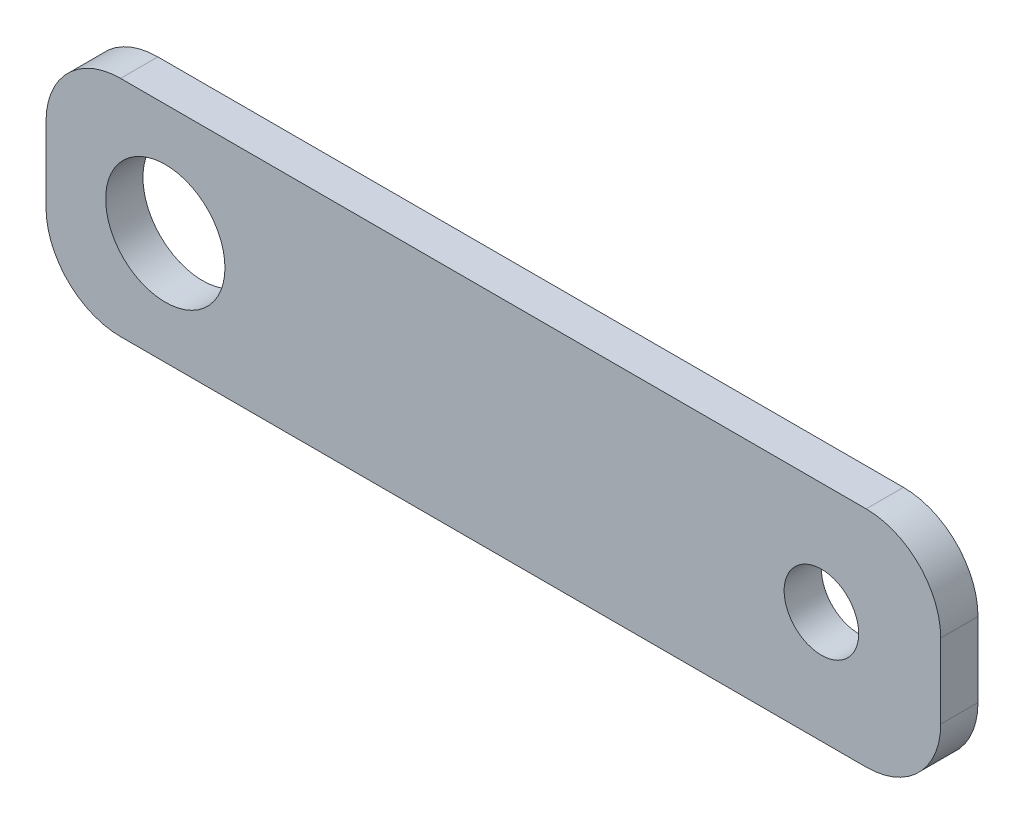
ISO-10303-21;
HEADER;
FILE_DESCRIPTION(('STEP AP214'),'2;1');
FILE_NAME('part.step','',(''),(''),'','','');
FILE_SCHEMA(('AUTOMOTIVE_DESIGN { 1 0 10303 214 1 1 1 1 }'));
ENDSEC;
DATA;
#1=APPLICATION_CONTEXT('core data for automotive mechanical design processes');
#2=APPLICATION_PROTOCOL_DEFINITION('international standard','automotive_design',2000,#1);
#3=PRODUCT_CONTEXT('',#1,'mechanical');
#4=PRODUCT('Part','Part','',(#3));
#5=PRODUCT_RELATED_PRODUCT_CATEGORY('part','',(#4));
#6=PRODUCT_DEFINITION_FORMATION('','',#4);
#7=PRODUCT_DEFINITION_CONTEXT('part definition',#1,'design');
#8=PRODUCT_DEFINITION('design','',#6,#7);
#9=PRODUCT_DEFINITION_SHAPE('','',#8);
#10=(LENGTH_UNIT() NAMED_UNIT(*) SI_UNIT(.MILLI.,.METRE.));
#11=(NAMED_UNIT(*) PLANE_ANGLE_UNIT() SI_UNIT($,.RADIAN.));
#12=(NAMED_UNIT(*) SI_UNIT($,.STERADIAN.) SOLID_ANGLE_UNIT());
#13=UNCERTAINTY_MEASURE_WITH_UNIT(LENGTH_MEASURE(1.E-05),#10,'distance_accuracy_value','');
#14=(GEOMETRIC_REPRESENTATION_CONTEXT(3) GLOBAL_UNCERTAINTY_ASSIGNED_CONTEXT((#13)) GLOBAL_UNIT_ASSIGNED_CONTEXT((#10,
#11,#12)) REPRESENTATION_CONTEXT('',''));
#15=CARTESIAN_POINT('',(0.,0.,0.));
#16=DIRECTION('',(0.,0.,1.));
#17=DIRECTION('',(1.,0.,0.));
#18=AXIS2_PLACEMENT_3D('',#15,#16,#17);
#19=CARTESIAN_POINT('',(-60.0000000000003,-15.0000000000002,5.));
#20=DIRECTION('',(1.00000000000001,0.,0.));
#21=DIRECTION('',(0.,0.,-1.));
#22=AXIS2_PLACEMENT_3D('',#19,#20,#21);
#23=PLANE('',#22);
#24=DIRECTION('',(0.,-1.00000000000001,0.));
#25=VECTOR('',#24,1.);
#26=CARTESIAN_POINT('',(-60.0000000000003,-15.0000000000002,0.));
#27=LINE('',#26,#25);
#28=CARTESIAN_POINT('',(-60.0000000000002,4.99999999999994,0.));
#29=VERTEX_POINT('',#28);
#30=CARTESIAN_POINT('',(-60.0000000000001,-5.00000000000002,0.));
#31=VERTEX_POINT('',#30);
#32=EDGE_CURVE('E131',#29,#31,#27,.T.);
#33=ORIENTED_EDGE('',*,*,#32,.T.);
#34=DIRECTION('',(0.,0.,-1.));
#35=VECTOR('',#34,1.);
#36=CARTESIAN_POINT('',(-60.0000000000001,-5.00000000000002,5.));
#37=LINE('',#36,#35);
#38=CARTESIAN_POINT('',(-60.0000000000001,-5.00000000000002,5.));
#39=VERTEX_POINT('',#38);
#40=EDGE_CURVE('E11',#31,#39,#37,.F.);
#41=ORIENTED_EDGE('',*,*,#40,.T.);
#42=DIRECTION('',(0.,-1.00000000000001,0.));
#43=VECTOR('',#42,1.);
#44=CARTESIAN_POINT('',(-60.0000000000003,-15.0000000000002,5.));
#45=LINE('',#44,#43);
#46=CARTESIAN_POINT('',(-60.0000000000002,4.99999999999994,5.));
#47=VERTEX_POINT('',#46);
#48=EDGE_CURVE('E129',#47,#39,#45,.T.);
#49=ORIENTED_EDGE('',*,*,#48,.F.);
#50=DIRECTION('',(0.,0.,-1.));
#51=VECTOR('',#50,1.);
#52=CARTESIAN_POINT('',(-60.0000000000002,4.99999999999994,5.));
#53=LINE('',#52,#51);
#54=EDGE_CURVE('E43',#47,#29,#53,.T.);
#55=ORIENTED_EDGE('',*,*,#54,.T.);
#56=EDGE_LOOP('',(#33,#41,#49,#55));
#57=FACE_BOUND('',#56,.T.);
#58=ADVANCED_FACE('F35',(#57),#23,.F.);
#59=CARTESIAN_POINT('',(60.0000000000001,-15.,5.));
#60=DIRECTION('',(0.,1.00000000000001,0.));
#61=DIRECTION('',(-1.00000000000001,0.,0.));
#62=AXIS2_PLACEMENT_3D('',#59,#60,#61);
#63=PLANE('',#62);
#64=DIRECTION('',(1.00000000000001,0.,0.));
#65=VECTOR('',#64,1.);
#66=CARTESIAN_POINT('',(60.0000000000001,-15.,0.));
#67=LINE('',#66,#65);
#68=CARTESIAN_POINT('',(-50.0000000000002,-15.0000000000002,0.));
#69=VERTEX_POINT('',#68);
#70=CARTESIAN_POINT('',(50.,-15.,0.));
#71=VERTEX_POINT('',#70);
#72=EDGE_CURVE('E127',#69,#71,#67,.T.);
#73=ORIENTED_EDGE('',*,*,#72,.T.);
#74=DIRECTION('',(0.,0.,-1.));
#75=VECTOR('',#74,1.);
#76=CARTESIAN_POINT('',(50.,-15.,5.));
#77=LINE('',#76,#75);
#78=CARTESIAN_POINT('',(50.,-15.,5.));
#79=VERTEX_POINT('',#78);
#80=EDGE_CURVE('E106',#71,#79,#77,.F.);
#81=ORIENTED_EDGE('',*,*,#80,.T.);
#82=DIRECTION('',(1.00000000000001,0.,0.));
#83=VECTOR('',#82,1.);
#84=CARTESIAN_POINT('',(60.0000000000001,-15.,5.));
#85=LINE('',#84,#83);
#86=CARTESIAN_POINT('',(-50.0000000000002,-15.0000000000002,5.));
#87=VERTEX_POINT('',#86);
#88=EDGE_CURVE('E174',#87,#79,#85,.T.);
#89=ORIENTED_EDGE('',*,*,#88,.F.);
#90=DIRECTION('',(0.,0.,-1.));
#91=VECTOR('',#90,1.);
#92=CARTESIAN_POINT('',(-50.0000000000002,-15.0000000000002,5.));
#93=LINE('',#92,#91);
#94=EDGE_CURVE('E111',#87,#69,#93,.T.);
#95=ORIENTED_EDGE('',*,*,#94,.T.);
#96=EDGE_LOOP('',(#73,#81,#89,#95));
#97=FACE_BOUND('',#96,.T.);
#98=ADVANCED_FACE('F197',(#97),#63,.F.);
#99=CARTESIAN_POINT('',(60.0000000000001,-15.,5.));
#100=DIRECTION('',(-1.00000000000001,0.,0.));
#101=DIRECTION('',(0.,-1.00000000000001,0.));
#102=AXIS2_PLACEMENT_3D('',#99,#100,#101);
#103=PLANE('',#102);
#104=DIRECTION('',(0.,1.00000000000001,0.));
#105=VECTOR('',#104,1.);
#106=CARTESIAN_POINT('',(60.0000000000001,-15.,5.));
#107=LINE('',#106,#105);
#108=CARTESIAN_POINT('',(60.0000000000001,-5.,5.));
#109=VERTEX_POINT('',#108);
#110=CARTESIAN_POINT('',(60.,4.99999999999999,5.));
#111=VERTEX_POINT('',#110);
#112=EDGE_CURVE('E120',#109,#111,#107,.T.);
#113=ORIENTED_EDGE('',*,*,#112,.F.);
#114=DIRECTION('',(0.,0.,-1.));
#115=VECTOR('',#114,1.);
#116=CARTESIAN_POINT('',(60.0000000000001,-5.,5.));
#117=LINE('',#116,#115);
#118=CARTESIAN_POINT('',(60.0000000000001,-5.,0.));
#119=VERTEX_POINT('',#118);
#120=EDGE_CURVE('E105',#109,#119,#117,.T.);
#121=ORIENTED_EDGE('',*,*,#120,.T.);
#122=DIRECTION('',(0.,1.00000000000001,0.));
#123=VECTOR('',#122,1.);
#124=CARTESIAN_POINT('',(60.0000000000001,-15.,0.));
#125=LINE('',#124,#123);
#126=CARTESIAN_POINT('',(60.,4.99999999999999,0.));
#127=VERTEX_POINT('',#126);
#128=EDGE_CURVE('E118',#119,#127,#125,.T.);
#129=ORIENTED_EDGE('',*,*,#128,.T.);
#130=DIRECTION('',(0.,0.,-1.));
#131=VECTOR('',#130,1.);
#132=CARTESIAN_POINT('',(60.,4.99999999999999,5.));
#133=LINE('',#132,#131);
#134=EDGE_CURVE('E122',#127,#111,#133,.F.);
#135=ORIENTED_EDGE('',*,*,#134,.T.);
#136=EDGE_LOOP('',(#113,#121,#129,#135));
#137=FACE_BOUND('',#136,.T.);
#138=ADVANCED_FACE('F117',(#137),#103,.F.);
#139=CARTESIAN_POINT('',(60.,15.,5.));
#140=DIRECTION('',(0.,-1.00000000000001,0.));
#141=DIRECTION('',(1.00000000000001,0.,0.));
#142=AXIS2_PLACEMENT_3D('',#139,#140,#141);
#143=PLANE('',#142);
#144=DIRECTION('',(-1.00000000000001,0.,0.));
#145=VECTOR('',#144,1.);
#146=CARTESIAN_POINT('',(60.,15.,5.));
#147=LINE('',#146,#145);
#148=CARTESIAN_POINT('',(50.0000000000003,15.0000000000001,5.));
#149=VERTEX_POINT('',#148);
#150=CARTESIAN_POINT('',(-50.0000000000003,15.,5.));
#151=VERTEX_POINT('',#150);
#152=EDGE_CURVE('E142',#149,#151,#147,.T.);
#153=ORIENTED_EDGE('',*,*,#152,.F.);
#154=DIRECTION('',(0.,0.,-1.));
#155=VECTOR('',#154,1.);
#156=CARTESIAN_POINT('',(50.0000000000003,15.0000000000001,5.));
#157=LINE('',#156,#155);
#158=CARTESIAN_POINT('',(50.0000000000003,15.0000000000001,0.));
#159=VERTEX_POINT('',#158);
#160=EDGE_CURVE('E159',#149,#159,#157,.T.);
#161=ORIENTED_EDGE('',*,*,#160,.T.);
#162=DIRECTION('',(-1.00000000000001,0.,0.));
#163=VECTOR('',#162,1.);
#164=CARTESIAN_POINT('',(60.,15.,0.));
#165=LINE('',#164,#163);
#166=CARTESIAN_POINT('',(-50.0000000000003,15.,0.));
#167=VERTEX_POINT('',#166);
#168=EDGE_CURVE('E126',#159,#167,#165,.T.);
#169=ORIENTED_EDGE('',*,*,#168,.T.);
#170=DIRECTION('',(0.,0.,-1.));
#171=VECTOR('',#170,1.);
#172=CARTESIAN_POINT('',(-50.0000000000003,15.,5.));
#173=LINE('',#172,#171);
#174=EDGE_CURVE('E50',#167,#151,#173,.F.);
#175=ORIENTED_EDGE('',*,*,#174,.T.);
#176=EDGE_LOOP('',(#153,#161,#169,#175));
#177=FACE_BOUND('',#176,.T.);
#178=ADVANCED_FACE('F190',(#177),#143,.F.);
#179=CARTESIAN_POINT('',(0.,0.,5.));
#180=DIRECTION('',(0.,0.,1.));
#181=DIRECTION('',(1.00000000000001,0.,0.));
#182=AXIS2_PLACEMENT_3D('',#179,#180,#181);
#183=PLANE('',#182);
#184=CARTESIAN_POINT('',(-44.,0.,5.));
#185=DIRECTION('',(0.,0.,1.));
#186=DIRECTION('',(1.00000000000001,0.,0.));
#187=AXIS2_PLACEMENT_3D('',#184,#185,#186);
#188=CIRCLE('',#187,8.);
#189=CARTESIAN_POINT('',(-36.,0.,5.));
#190=VERTEX_POINT('',#189);
#191=EDGE_CURVE('E139',#190,#190,#188,.T.);
#192=ORIENTED_EDGE('',*,*,#191,.F.);
#193=EDGE_LOOP('',(#192));
#194=FACE_BOUND('',#193,.T.);
#195=CARTESIAN_POINT('',(44.0000000000001,0.,5.));
#196=DIRECTION('',(0.,0.,1.));
#197=DIRECTION('',(1.00000000000001,0.,0.));
#198=AXIS2_PLACEMENT_3D('',#195,#196,#197);
#199=CIRCLE('',#198,5.);
#200=CARTESIAN_POINT('',(49.0000000000002,0.,5.));
#201=VERTEX_POINT('',#200);
#202=EDGE_CURVE('E178',#201,#201,#199,.T.);
#203=ORIENTED_EDGE('',*,*,#202,.F.);
#204=EDGE_LOOP('',(#203));
#205=FACE_BOUND('',#204,.T.);
#206=ORIENTED_EDGE('',*,*,#88,.T.);
#207=CARTESIAN_POINT('',(50.,-4.99999999999999,5.));
#208=DIRECTION('',(0.,0.,1.));
#209=DIRECTION('',(1.00000000000001,0.,0.));
#210=AXIS2_PLACEMENT_3D('',#207,#208,#209);
#211=CIRCLE('',#210,10.);
#212=EDGE_CURVE('E156',#79,#109,#211,.T.);
#213=ORIENTED_EDGE('',*,*,#212,.T.);
#214=ORIENTED_EDGE('',*,*,#112,.T.);
#215=CARTESIAN_POINT('',(50.,4.99999999999999,5.));
#216=DIRECTION('',(0.,0.,1.));
#217=DIRECTION('',(1.00000000000001,0.,0.));
#218=AXIS2_PLACEMENT_3D('',#215,#216,#217);
#219=CIRCLE('',#218,10.);
#220=EDGE_CURVE('E57',#111,#149,#219,.T.);
#221=ORIENTED_EDGE('',*,*,#220,.T.);
#222=ORIENTED_EDGE('',*,*,#152,.T.);
#223=CARTESIAN_POINT('',(-50.,4.99999999999999,5.));
#224=DIRECTION('',(0.,0.,1.));
#225=DIRECTION('',(1.00000000000001,0.,0.));
#226=AXIS2_PLACEMENT_3D('',#223,#224,#225);
#227=CIRCLE('',#226,10.);
#228=EDGE_CURVE('E151',#151,#47,#227,.T.);
#229=ORIENTED_EDGE('',*,*,#228,.T.);
#230=ORIENTED_EDGE('',*,*,#48,.T.);
#231=CARTESIAN_POINT('',(-50.0000000000001,-5.00000000000005,5.));
#232=DIRECTION('',(0.,0.,1.));
#233=DIRECTION('',(1.00000000000001,0.,0.));
#234=AXIS2_PLACEMENT_3D('',#231,#232,#233);
#235=CIRCLE('',#234,10.);
#236=EDGE_CURVE('E153',#39,#87,#235,.T.);
#237=ORIENTED_EDGE('',*,*,#236,.T.);
#238=EDGE_LOOP('',(#206,#213,#214,#221,#222,#229,#230,#237));
#239=FACE_BOUND('',#238,.T.);
#240=ADVANCED_FACE('F187',(#194,#205,#239),#183,.T.);
#241=CARTESIAN_POINT('',(0.,0.,0.));
#242=DIRECTION('',(0.,0.,1.));
#243=DIRECTION('',(1.00000000000001,0.,0.));
#244=AXIS2_PLACEMENT_3D('',#241,#242,#243);
#245=PLANE('',#244);
#246=CARTESIAN_POINT('',(-44.,0.,0.));
#247=DIRECTION('',(0.,0.,1.));
#248=DIRECTION('',(1.00000000000001,0.,0.));
#249=AXIS2_PLACEMENT_3D('',#246,#247,#248);
#250=CIRCLE('',#249,8.);
#251=CARTESIAN_POINT('',(-36.,0.,0.));
#252=VERTEX_POINT('',#251);
#253=EDGE_CURVE('E138',#252,#252,#250,.T.);
#254=ORIENTED_EDGE('',*,*,#253,.T.);
#255=EDGE_LOOP('',(#254));
#256=FACE_BOUND('',#255,.T.);
#257=CARTESIAN_POINT('',(44.0000000000001,0.,0.));
#258=DIRECTION('',(0.,0.,1.));
#259=DIRECTION('',(1.00000000000001,0.,0.));
#260=AXIS2_PLACEMENT_3D('',#257,#258,#259);
#261=CIRCLE('',#260,5.);
#262=CARTESIAN_POINT('',(49.0000000000002,0.,0.));
#263=VERTEX_POINT('',#262);
#264=EDGE_CURVE('E135',#263,#263,#261,.T.);
#265=ORIENTED_EDGE('',*,*,#264,.T.);
#266=EDGE_LOOP('',(#265));
#267=FACE_BOUND('',#266,.T.);
#268=ORIENTED_EDGE('',*,*,#128,.F.);
#269=CARTESIAN_POINT('',(50.,-4.99999999999999,0.));
#270=DIRECTION('',(0.,0.,1.));
#271=DIRECTION('',(1.00000000000001,0.,0.));
#272=AXIS2_PLACEMENT_3D('',#269,#270,#271);
#273=CIRCLE('',#272,10.);
#274=EDGE_CURVE('E101',#119,#71,#273,.F.);
#275=ORIENTED_EDGE('',*,*,#274,.T.);
#276=ORIENTED_EDGE('',*,*,#72,.F.);
#277=CARTESIAN_POINT('',(-50.0000000000001,-5.00000000000005,0.));
#278=DIRECTION('',(0.,0.,1.));
#279=DIRECTION('',(1.00000000000001,0.,0.));
#280=AXIS2_PLACEMENT_3D('',#277,#278,#279);
#281=CIRCLE('',#280,10.);
#282=EDGE_CURVE('E145',#69,#31,#281,.F.);
#283=ORIENTED_EDGE('',*,*,#282,.T.);
#284=ORIENTED_EDGE('',*,*,#32,.F.);
#285=CARTESIAN_POINT('',(-50.,4.99999999999999,0.));
#286=DIRECTION('',(0.,0.,1.));
#287=DIRECTION('',(1.00000000000001,0.,0.));
#288=AXIS2_PLACEMENT_3D('',#285,#286,#287);
#289=CIRCLE('',#288,10.);
#290=EDGE_CURVE('E121',#29,#167,#289,.F.);
#291=ORIENTED_EDGE('',*,*,#290,.T.);
#292=ORIENTED_EDGE('',*,*,#168,.F.);
#293=CARTESIAN_POINT('',(50.,4.99999999999999,0.));
#294=DIRECTION('',(0.,0.,1.));
#295=DIRECTION('',(1.00000000000001,0.,0.));
#296=AXIS2_PLACEMENT_3D('',#293,#294,#295);
#297=CIRCLE('',#296,10.);
#298=EDGE_CURVE('E112',#159,#127,#297,.F.);
#299=ORIENTED_EDGE('',*,*,#298,.T.);
#300=EDGE_LOOP('',(#268,#275,#276,#283,#284,#291,#292,#299));
#301=FACE_BOUND('',#300,.T.);
#302=ADVANCED_FACE('F124',(#256,#267,#301),#245,.F.);
#303=CARTESIAN_POINT('',(44.0000000000001,0.,-5.));
#304=DIRECTION('',(0.,0.,1.));
#305=DIRECTION('',(1.00000000000001,0.,0.));
#306=AXIS2_PLACEMENT_3D('',#303,#304,#305);
#307=CYLINDRICAL_SURFACE('',#306,5.);
#308=ORIENTED_EDGE('',*,*,#202,.T.);
#309=EDGE_LOOP('',(#308));
#310=FACE_BOUND('',#309,.T.);
#311=ORIENTED_EDGE('',*,*,#264,.F.);
#312=EDGE_LOOP('',(#311));
#313=FACE_BOUND('',#312,.T.);
#314=ADVANCED_FACE('F227',(#310,#313),#307,.F.);
#315=CARTESIAN_POINT('',(-44.,0.,-5.));
#316=DIRECTION('',(0.,0.,1.));
#317=DIRECTION('',(1.00000000000001,0.,0.));
#318=AXIS2_PLACEMENT_3D('',#315,#316,#317);
#319=CYLINDRICAL_SURFACE('',#318,8.);
#320=ORIENTED_EDGE('',*,*,#191,.T.);
#321=EDGE_LOOP('',(#320));
#322=FACE_BOUND('',#321,.T.);
#323=ORIENTED_EDGE('',*,*,#253,.F.);
#324=EDGE_LOOP('',(#323));
#325=FACE_BOUND('',#324,.T.);
#326=ADVANCED_FACE('F184',(#322,#325),#319,.F.);
#327=CARTESIAN_POINT('',(50.,-4.99999999999999,5.));
#328=DIRECTION('',(0.,0.,-1.));
#329=DIRECTION('',(-1.00000000000001,0.,0.));
#330=AXIS2_PLACEMENT_3D('',#327,#328,#329);
#331=CYLINDRICAL_SURFACE('',#330,10.);
#332=ORIENTED_EDGE('',*,*,#212,.F.);
#333=ORIENTED_EDGE('',*,*,#80,.F.);
#334=ORIENTED_EDGE('',*,*,#274,.F.);
#335=ORIENTED_EDGE('',*,*,#120,.F.);
#336=EDGE_LOOP('',(#332,#333,#334,#335));
#337=FACE_BOUND('',#336,.T.);
#338=ADVANCED_FACE('F104',(#337),#331,.T.);
#339=CARTESIAN_POINT('',(50.,4.99999999999999,5.));
#340=DIRECTION('',(0.,0.,-1.));
#341=DIRECTION('',(-1.00000000000001,0.,0.));
#342=AXIS2_PLACEMENT_3D('',#339,#340,#341);
#343=CYLINDRICAL_SURFACE('',#342,10.);
#344=ORIENTED_EDGE('',*,*,#220,.F.);
#345=ORIENTED_EDGE('',*,*,#134,.F.);
#346=ORIENTED_EDGE('',*,*,#298,.F.);
#347=ORIENTED_EDGE('',*,*,#160,.F.);
#348=EDGE_LOOP('',(#344,#345,#346,#347));
#349=FACE_BOUND('',#348,.T.);
#350=ADVANCED_FACE('F204',(#349),#343,.T.);
#351=CARTESIAN_POINT('',(-50.0000000000001,-5.00000000000005,5.));
#352=DIRECTION('',(0.,0.,-1.));
#353=DIRECTION('',(-1.00000000000001,0.,0.));
#354=AXIS2_PLACEMENT_3D('',#351,#352,#353);
#355=CYLINDRICAL_SURFACE('',#354,10.);
#356=ORIENTED_EDGE('',*,*,#236,.F.);
#357=ORIENTED_EDGE('',*,*,#40,.F.);
#358=ORIENTED_EDGE('',*,*,#282,.F.);
#359=ORIENTED_EDGE('',*,*,#94,.F.);
#360=EDGE_LOOP('',(#356,#357,#358,#359));
#361=FACE_BOUND('',#360,.T.);
#362=ADVANCED_FACE('F199',(#361),#355,.T.);
#363=CARTESIAN_POINT('',(-50.,4.99999999999999,5.));
#364=DIRECTION('',(0.,0.,-1.));
#365=DIRECTION('',(-1.00000000000001,0.,0.));
#366=AXIS2_PLACEMENT_3D('',#363,#364,#365);
#367=CYLINDRICAL_SURFACE('',#366,10.);
#368=ORIENTED_EDGE('',*,*,#228,.F.);
#369=ORIENTED_EDGE('',*,*,#174,.F.);
#370=ORIENTED_EDGE('',*,*,#290,.F.);
#371=ORIENTED_EDGE('',*,*,#54,.F.);
#372=EDGE_LOOP('',(#368,#369,#370,#371));
#373=FACE_BOUND('',#372,.T.);
#374=ADVANCED_FACE('F37',(#373),#367,.T.);
#375=CLOSED_SHELL('',(#58,#98,#138,#178,#240,#302,#314,#326,#338,#350,#362,#374));
#376=MANIFOLD_SOLID_BREP('B2',#375);
#377=ADVANCED_BREP_SHAPE_REPRESENTATION('',(#18,#376),#14);
#378=SHAPE_DEFINITION_REPRESENTATION(#9,#377);
ENDSEC;
END-ISO-10303-21;
